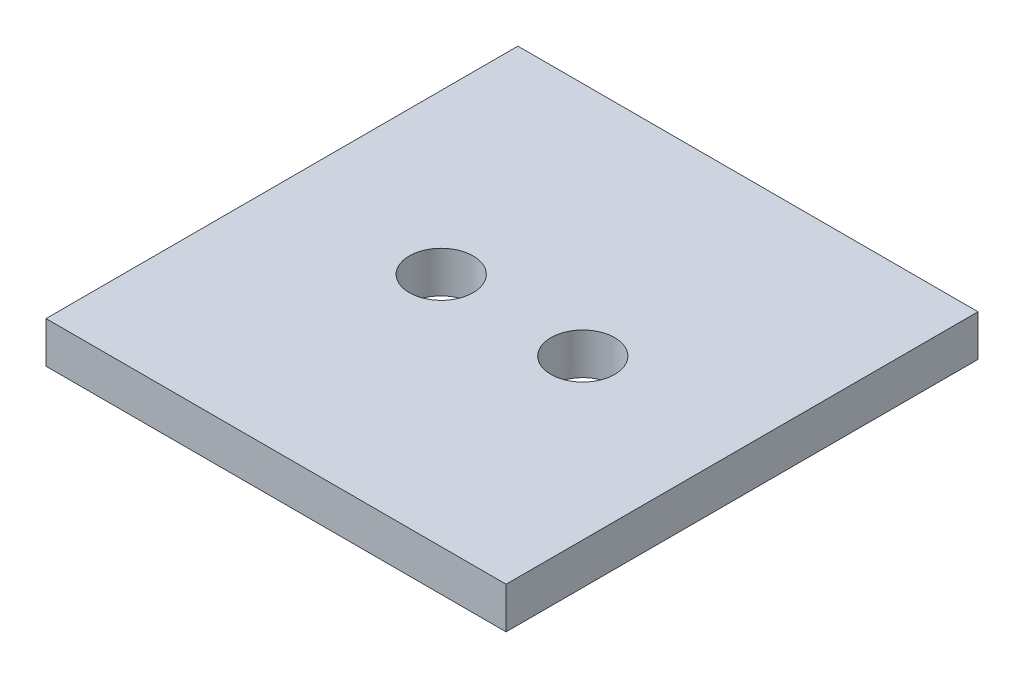
ISO-10303-21;
HEADER;
FILE_DESCRIPTION(('STEP AP214'),'2;1');
FILE_NAME('part.step','',(''),(''),'','','');
FILE_SCHEMA(('AUTOMOTIVE_DESIGN { 1 0 10303 214 1 1 1 1 }'));
ENDSEC;
DATA;
#1=APPLICATION_CONTEXT('core data for automotive mechanical design processes');
#2=APPLICATION_PROTOCOL_DEFINITION('international standard','automotive_design',2000,#1);
#3=PRODUCT_CONTEXT('',#1,'mechanical');
#4=PRODUCT('Part','Part','',(#3));
#5=PRODUCT_RELATED_PRODUCT_CATEGORY('part','',(#4));
#6=PRODUCT_DEFINITION_FORMATION('','',#4);
#7=PRODUCT_DEFINITION_CONTEXT('part definition',#1,'design');
#8=PRODUCT_DEFINITION('design','',#6,#7);
#9=PRODUCT_DEFINITION_SHAPE('','',#8);
#10=(LENGTH_UNIT() NAMED_UNIT(*) SI_UNIT(.MILLI.,.METRE.));
#11=(NAMED_UNIT(*) PLANE_ANGLE_UNIT() SI_UNIT($,.RADIAN.));
#12=(NAMED_UNIT(*) SI_UNIT($,.STERADIAN.) SOLID_ANGLE_UNIT());
#13=UNCERTAINTY_MEASURE_WITH_UNIT(LENGTH_MEASURE(1.E-05),#10,'distance_accuracy_value','');
#14=(GEOMETRIC_REPRESENTATION_CONTEXT(3) GLOBAL_UNCERTAINTY_ASSIGNED_CONTEXT((#13)) GLOBAL_UNIT_ASSIGNED_CONTEXT((#10,
#11,#12)) REPRESENTATION_CONTEXT('',''));
#15=CARTESIAN_POINT('',(0.,0.,0.));
#16=DIRECTION('',(0.,0.,1.));
#17=DIRECTION('',(1.,0.,0.));
#18=AXIS2_PLACEMENT_3D('',#15,#16,#17);
#19=CARTESIAN_POINT('',(9.75,1.75,10.));
#20=DIRECTION('',(-1.,0.,0.));
#21=DIRECTION('',(0.,0.,1.));
#22=AXIS2_PLACEMENT_3D('',#19,#20,#21);
#23=PLANE('',#22);
#24=DIRECTION('',(0.,0.,-1.));
#25=VECTOR('',#24,1.);
#26=CARTESIAN_POINT('',(9.75,0.,10.));
#27=LINE('',#26,#25);
#28=CARTESIAN_POINT('',(9.75,0.,10.));
#29=VERTEX_POINT('',#28);
#30=CARTESIAN_POINT('',(9.75,0.,-10.));
#31=VERTEX_POINT('',#30);
#32=EDGE_CURVE('E102',#29,#31,#27,.T.);
#33=ORIENTED_EDGE('',*,*,#32,.T.);
#34=DIRECTION('',(0.,-1.,0.));
#35=VECTOR('',#34,1.);
#36=CARTESIAN_POINT('',(9.75,1.75,-10.));
#37=LINE('',#36,#35);
#38=CARTESIAN_POINT('',(9.75,1.75,-10.));
#39=VERTEX_POINT('',#38);
#40=EDGE_CURVE('E11',#39,#31,#37,.T.);
#41=ORIENTED_EDGE('',*,*,#40,.F.);
#42=DIRECTION('',(0.,0.,-1.));
#43=VECTOR('',#42,1.);
#44=CARTESIAN_POINT('',(9.75,1.75,10.));
#45=LINE('',#44,#43);
#46=CARTESIAN_POINT('',(9.75,1.75,10.));
#47=VERTEX_POINT('',#46);
#48=EDGE_CURVE('E93',#47,#39,#45,.T.);
#49=ORIENTED_EDGE('',*,*,#48,.F.);
#50=DIRECTION('',(0.,-1.,0.));
#51=VECTOR('',#50,1.);
#52=CARTESIAN_POINT('',(9.75,1.75,10.));
#53=LINE('',#52,#51);
#54=EDGE_CURVE('E99',#47,#29,#53,.T.);
#55=ORIENTED_EDGE('',*,*,#54,.T.);
#56=EDGE_LOOP('',(#33,#41,#49,#55));
#57=FACE_BOUND('',#56,.T.);
#58=ADVANCED_FACE('F39',(#57),#23,.F.);
#59=CARTESIAN_POINT('',(-9.75,1.75,-10.));
#60=DIRECTION('',(0.,0.,1.));
#61=DIRECTION('',(1.,0.,0.));
#62=AXIS2_PLACEMENT_3D('',#59,#60,#61);
#63=PLANE('',#62);
#64=DIRECTION('',(-1.,0.,0.));
#65=VECTOR('',#64,1.);
#66=CARTESIAN_POINT('',(-9.75,0.,-10.));
#67=LINE('',#66,#65);
#68=CARTESIAN_POINT('',(-9.75,0.,-10.));
#69=VERTEX_POINT('',#68);
#70=EDGE_CURVE('E92',#31,#69,#67,.T.);
#71=ORIENTED_EDGE('',*,*,#70,.T.);
#72=DIRECTION('',(0.,-1.,0.));
#73=VECTOR('',#72,1.);
#74=CARTESIAN_POINT('',(-9.75,1.75,-10.));
#75=LINE('',#74,#73);
#76=CARTESIAN_POINT('',(-9.75,1.75,-10.));
#77=VERTEX_POINT('',#76);
#78=EDGE_CURVE('E48',#77,#69,#75,.T.);
#79=ORIENTED_EDGE('',*,*,#78,.F.);
#80=DIRECTION('',(-1.,0.,0.));
#81=VECTOR('',#80,1.);
#82=CARTESIAN_POINT('',(-9.75,1.75,-10.));
#83=LINE('',#82,#81);
#84=EDGE_CURVE('E88',#39,#77,#83,.T.);
#85=ORIENTED_EDGE('',*,*,#84,.F.);
#86=ORIENTED_EDGE('',*,*,#40,.T.);
#87=EDGE_LOOP('',(#71,#79,#85,#86));
#88=FACE_BOUND('',#87,.T.);
#89=ADVANCED_FACE('F94',(#88),#63,.F.);
#90=CARTESIAN_POINT('',(-9.75,1.75,10.));
#91=DIRECTION('',(1.,0.,0.));
#92=DIRECTION('',(0.,0.,-1.));
#93=AXIS2_PLACEMENT_3D('',#90,#91,#92);
#94=PLANE('',#93);
#95=DIRECTION('',(0.,0.,1.));
#96=VECTOR('',#95,1.);
#97=CARTESIAN_POINT('',(-9.75,0.,10.));
#98=LINE('',#97,#96);
#99=CARTESIAN_POINT('',(-9.75,0.,10.));
#100=VERTEX_POINT('',#99);
#101=EDGE_CURVE('E71',#69,#100,#98,.T.);
#102=ORIENTED_EDGE('',*,*,#101,.T.);
#103=DIRECTION('',(0.,-1.,0.));
#104=VECTOR('',#103,1.);
#105=CARTESIAN_POINT('',(-9.75,1.75,10.));
#106=LINE('',#105,#104);
#107=CARTESIAN_POINT('',(-9.75,1.75,10.));
#108=VERTEX_POINT('',#107);
#109=EDGE_CURVE('E96',#108,#100,#106,.T.);
#110=ORIENTED_EDGE('',*,*,#109,.F.);
#111=DIRECTION('',(0.,0.,1.));
#112=VECTOR('',#111,1.);
#113=CARTESIAN_POINT('',(-9.75,1.75,10.));
#114=LINE('',#113,#112);
#115=EDGE_CURVE('E90',#77,#108,#114,.T.);
#116=ORIENTED_EDGE('',*,*,#115,.F.);
#117=ORIENTED_EDGE('',*,*,#78,.T.);
#118=EDGE_LOOP('',(#102,#110,#116,#117));
#119=FACE_BOUND('',#118,.T.);
#120=ADVANCED_FACE('F98',(#119),#94,.F.);
#121=CARTESIAN_POINT('',(-9.75,1.75,10.));
#122=DIRECTION('',(0.,0.,-1.));
#123=DIRECTION('',(-1.,0.,0.));
#124=AXIS2_PLACEMENT_3D('',#121,#122,#123);
#125=PLANE('',#124);
#126=DIRECTION('',(1.,0.,0.));
#127=VECTOR('',#126,1.);
#128=CARTESIAN_POINT('',(-9.75,0.,10.));
#129=LINE('',#128,#127);
#130=EDGE_CURVE('E76',#100,#29,#129,.T.);
#131=ORIENTED_EDGE('',*,*,#130,.T.);
#132=ORIENTED_EDGE('',*,*,#54,.F.);
#133=DIRECTION('',(1.,0.,0.));
#134=VECTOR('',#133,1.);
#135=CARTESIAN_POINT('',(-9.75,1.75,10.));
#136=LINE('',#135,#134);
#137=EDGE_CURVE('E57',#108,#47,#136,.T.);
#138=ORIENTED_EDGE('',*,*,#137,.F.);
#139=ORIENTED_EDGE('',*,*,#109,.T.);
#140=EDGE_LOOP('',(#131,#132,#138,#139));
#141=FACE_BOUND('',#140,.T.);
#142=ADVANCED_FACE('F112',(#141),#125,.F.);
#143=CARTESIAN_POINT('',(0.,1.75,0.));
#144=DIRECTION('',(0.,-1.,0.));
#145=DIRECTION('',(0.,0.,-1.));
#146=AXIS2_PLACEMENT_3D('',#143,#144,#145);
#147=PLANE('',#146);
#148=CARTESIAN_POINT('',(-3.,1.75,0.));
#149=DIRECTION('',(0.,1.,0.));
#150=DIRECTION('',(0.,0.,1.));
#151=AXIS2_PLACEMENT_3D('',#148,#149,#150);
#152=CIRCLE('',#151,1.35254999999999);
#153=CARTESIAN_POINT('',(-3.,1.75,1.35254999999999));
#154=VERTEX_POINT('',#153);
#155=EDGE_CURVE('E122',#154,#154,#152,.T.);
#156=ORIENTED_EDGE('',*,*,#155,.F.);
#157=EDGE_LOOP('',(#156));
#158=FACE_BOUND('',#157,.T.);
#159=CARTESIAN_POINT('',(3.,1.75,0.));
#160=DIRECTION('',(0.,1.,0.));
#161=DIRECTION('',(0.,0.,1.));
#162=AXIS2_PLACEMENT_3D('',#159,#160,#161);
#163=CIRCLE('',#162,1.35254999999999);
#164=CARTESIAN_POINT('',(3.,1.75,1.35254999999999));
#165=VERTEX_POINT('',#164);
#166=EDGE_CURVE('E120',#165,#165,#163,.T.);
#167=ORIENTED_EDGE('',*,*,#166,.F.);
#168=EDGE_LOOP('',(#167));
#169=FACE_BOUND('',#168,.T.);
#170=ORIENTED_EDGE('',*,*,#48,.T.);
#171=ORIENTED_EDGE('',*,*,#84,.T.);
#172=ORIENTED_EDGE('',*,*,#115,.T.);
#173=ORIENTED_EDGE('',*,*,#137,.T.);
#174=EDGE_LOOP('',(#170,#171,#172,#173));
#175=FACE_BOUND('',#174,.T.);
#176=ADVANCED_FACE('F87',(#158,#169,#175),#147,.F.);
#177=CARTESIAN_POINT('',(0.,0.,0.));
#178=DIRECTION('',(0.,-1.,0.));
#179=DIRECTION('',(0.,0.,-1.));
#180=AXIS2_PLACEMENT_3D('',#177,#178,#179);
#181=PLANE('',#180);
#182=CARTESIAN_POINT('',(-3.,0.,0.));
#183=DIRECTION('',(0.,-1.,0.));
#184=DIRECTION('',(0.,0.,-1.));
#185=AXIS2_PLACEMENT_3D('',#182,#183,#184);
#186=CIRCLE('',#185,1.35254999999999);
#187=CARTESIAN_POINT('',(-3.,0.,-1.35254999999999));
#188=VERTEX_POINT('',#187);
#189=EDGE_CURVE('E118',#188,#188,#186,.T.);
#190=ORIENTED_EDGE('',*,*,#189,.F.);
#191=EDGE_LOOP('',(#190));
#192=FACE_BOUND('',#191,.T.);
#193=CARTESIAN_POINT('',(3.,0.,0.));
#194=DIRECTION('',(0.,-1.,0.));
#195=DIRECTION('',(0.,0.,-1.));
#196=AXIS2_PLACEMENT_3D('',#193,#194,#195);
#197=CIRCLE('',#196,1.35254999999999);
#198=CARTESIAN_POINT('',(3.,0.,-1.35254999999999));
#199=VERTEX_POINT('',#198);
#200=EDGE_CURVE('E45',#199,#199,#197,.T.);
#201=ORIENTED_EDGE('',*,*,#200,.F.);
#202=EDGE_LOOP('',(#201));
#203=FACE_BOUND('',#202,.T.);
#204=ORIENTED_EDGE('',*,*,#32,.F.);
#205=ORIENTED_EDGE('',*,*,#130,.F.);
#206=ORIENTED_EDGE('',*,*,#101,.F.);
#207=ORIENTED_EDGE('',*,*,#70,.F.);
#208=EDGE_LOOP('',(#204,#205,#206,#207));
#209=FACE_BOUND('',#208,.T.);
#210=ADVANCED_FACE('F111',(#192,#203,#209),#181,.T.);
#211=CARTESIAN_POINT('',(3.,1.75,0.));
#212=DIRECTION('',(0.,1.,0.));
#213=DIRECTION('',(0.,0.,1.));
#214=AXIS2_PLACEMENT_3D('',#211,#212,#213);
#215=CYLINDRICAL_SURFACE('',#214,1.35254999999999);
#216=ORIENTED_EDGE('',*,*,#200,.T.);
#217=EDGE_LOOP('',(#216));
#218=FACE_BOUND('',#217,.T.);
#219=ORIENTED_EDGE('',*,*,#166,.T.);
#220=EDGE_LOOP('',(#219));
#221=FACE_BOUND('',#220,.T.);
#222=ADVANCED_FACE('F131',(#218,#221),#215,.F.);
#223=CARTESIAN_POINT('',(-3.,1.75,0.));
#224=DIRECTION('',(0.,1.,0.));
#225=DIRECTION('',(0.,0.,1.));
#226=AXIS2_PLACEMENT_3D('',#223,#224,#225);
#227=CYLINDRICAL_SURFACE('',#226,1.35254999999999);
#228=ORIENTED_EDGE('',*,*,#189,.T.);
#229=EDGE_LOOP('',(#228));
#230=FACE_BOUND('',#229,.T.);
#231=ORIENTED_EDGE('',*,*,#155,.T.);
#232=EDGE_LOOP('',(#231));
#233=FACE_BOUND('',#232,.T.);
#234=ADVANCED_FACE('F130',(#230,#233),#227,.F.);
#235=CLOSED_SHELL('',(#58,#89,#120,#142,#176,#210,#222,#234));
#236=MANIFOLD_SOLID_BREP('B2',#235);
#237=ADVANCED_BREP_SHAPE_REPRESENTATION('',(#18,#236),#14);
#238=SHAPE_DEFINITION_REPRESENTATION(#9,#237);
ENDSEC;
END-ISO-10303-21;
